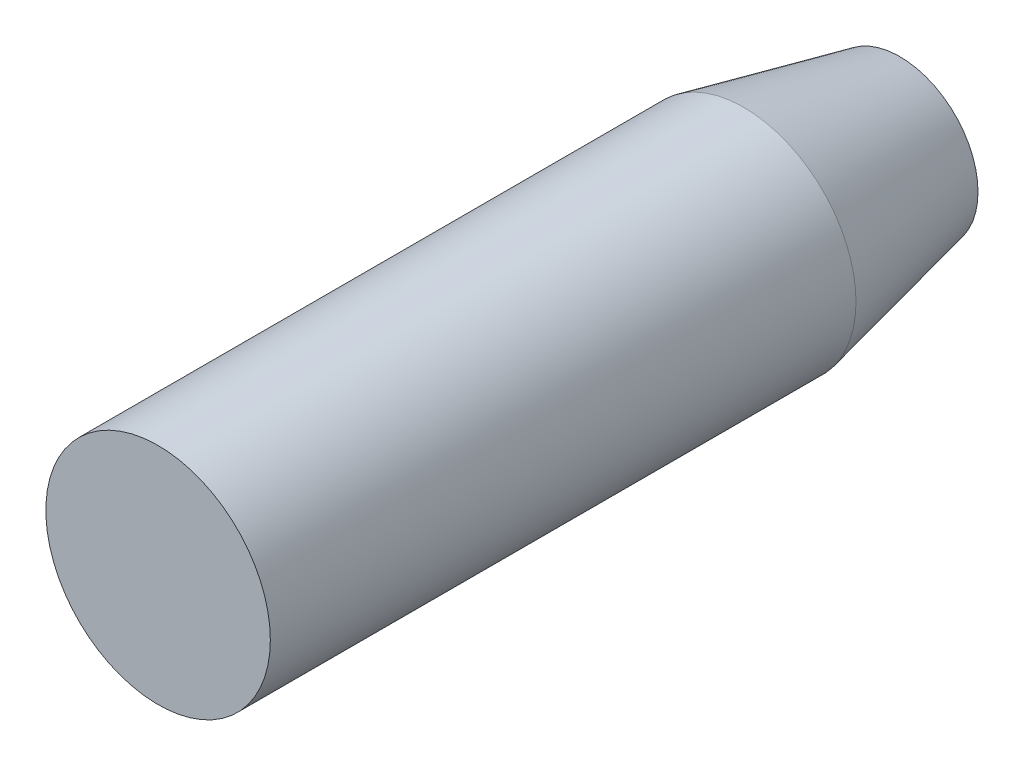
ISO-10303-21;
HEADER;
FILE_DESCRIPTION(('STEP AP214'),'2;1');
FILE_NAME('part.step','',(''),(''),'','','');
FILE_SCHEMA(('AUTOMOTIVE_DESIGN { 1 0 10303 214 1 1 1 1 }'));
ENDSEC;
DATA;
#1=APPLICATION_CONTEXT('core data for automotive mechanical design processes');
#2=APPLICATION_PROTOCOL_DEFINITION('international standard','automotive_design',2000,#1);
#3=PRODUCT_CONTEXT('',#1,'mechanical');
#4=PRODUCT('Part','Part','',(#3));
#5=PRODUCT_RELATED_PRODUCT_CATEGORY('part','',(#4));
#6=PRODUCT_DEFINITION_FORMATION('','',#4);
#7=PRODUCT_DEFINITION_CONTEXT('part definition',#1,'design');
#8=PRODUCT_DEFINITION('design','',#6,#7);
#9=PRODUCT_DEFINITION_SHAPE('','',#8);
#10=(LENGTH_UNIT() NAMED_UNIT(*) SI_UNIT(.MILLI.,.METRE.));
#11=(NAMED_UNIT(*) PLANE_ANGLE_UNIT() SI_UNIT($,.RADIAN.));
#12=(NAMED_UNIT(*) SI_UNIT($,.STERADIAN.) SOLID_ANGLE_UNIT());
#13=UNCERTAINTY_MEASURE_WITH_UNIT(LENGTH_MEASURE(1.E-05),#10,'distance_accuracy_value','');
#14=(GEOMETRIC_REPRESENTATION_CONTEXT(3) GLOBAL_UNCERTAINTY_ASSIGNED_CONTEXT((#13)) GLOBAL_UNIT_ASSIGNED_CONTEXT((#10,
#11,#12)) REPRESENTATION_CONTEXT('',''));
#15=CARTESIAN_POINT('',(0.,0.,0.));
#16=DIRECTION('',(0.,0.,1.));
#17=DIRECTION('',(1.,0.,0.));
#18=AXIS2_PLACEMENT_3D('',#15,#16,#17);
#19=CARTESIAN_POINT('',(0.,0.,0.));
#20=DIRECTION('',(0.,0.,1.));
#21=DIRECTION('',(1.,0.,0.));
#22=AXIS2_PLACEMENT_3D('',#19,#20,#21);
#23=PLANE('',#22);
#24=CARTESIAN_POINT('',(0.,0.,3.88231113923609E-12));
#25=DIRECTION('',(0.,0.,1.));
#26=DIRECTION('',(1.,0.,0.));
#27=AXIS2_PLACEMENT_3D('',#24,#25,#26);
#28=CIRCLE('',#27,12.6999999999822);
#29=CARTESIAN_POINT('',(12.6999999999822,0.,3.88231113923609E-12));
#30=VERTEX_POINT('',#29);
#31=EDGE_CURVE('E18',#30,#30,#28,.T.);
#32=ORIENTED_EDGE('',*,*,#31,.F.);
#33=EDGE_LOOP('',(#32));
#34=FACE_BOUND('',#33,.T.);
#35=ADVANCED_FACE('F15',(#34),#23,.F.);
#36=CARTESIAN_POINT('',(0.,0.,120.65));
#37=DIRECTION('',(0.,0.,1.));
#38=DIRECTION('',(1.,0.,0.));
#39=AXIS2_PLACEMENT_3D('',#36,#37,#38);
#40=PLANE('',#39);
#41=CARTESIAN_POINT('',(0.,0.,120.65));
#42=DIRECTION('',(0.,0.,1.));
#43=DIRECTION('',(1.,0.,0.));
#44=AXIS2_PLACEMENT_3D('',#41,#42,#43);
#45=CIRCLE('',#44,18.25625);
#46=CARTESIAN_POINT('',(18.25625,0.,120.65));
#47=VERTEX_POINT('',#46);
#48=EDGE_CURVE('E22',#47,#47,#45,.F.);
#49=ORIENTED_EDGE('',*,*,#48,.F.);
#50=EDGE_LOOP('',(#49));
#51=FACE_BOUND('',#50,.T.);
#52=ADVANCED_FACE('F38',(#51),#40,.T.);
#53=CARTESIAN_POINT('',(0.,0.,25.4));
#54=DIRECTION('',(0.,0.,1.));
#55=DIRECTION('',(1.,0.,0.));
#56=AXIS2_PLACEMENT_3D('',#53,#54,#55);
#57=CONICAL_SURFACE('',#56,18.25625,0.215357699698438);
#58=ORIENTED_EDGE('',*,*,#31,.T.);
#59=EDGE_LOOP('',(#58));
#60=FACE_BOUND('',#59,.T.);
#61=CARTESIAN_POINT('',(0.,0.,25.4));
#62=DIRECTION('',(0.,0.,1.));
#63=DIRECTION('',(1.,0.,0.));
#64=AXIS2_PLACEMENT_3D('',#61,#62,#63);
#65=CIRCLE('',#64,18.25625);
#66=CARTESIAN_POINT('',(18.25625,0.,25.4));
#67=VERTEX_POINT('',#66);
#68=EDGE_CURVE('E10',#67,#67,#65,.T.);
#69=ORIENTED_EDGE('',*,*,#68,.F.);
#70=EDGE_LOOP('',(#69));
#71=FACE_BOUND('',#70,.T.);
#72=ADVANCED_FACE('F34',(#60,#71),#57,.T.);
#73=CARTESIAN_POINT('',(0.,0.,0.));
#74=DIRECTION('',(0.,0.,1.));
#75=DIRECTION('',(1.,0.,0.));
#76=AXIS2_PLACEMENT_3D('',#73,#74,#75);
#77=CYLINDRICAL_SURFACE('',#76,18.25625);
#78=ORIENTED_EDGE('',*,*,#68,.T.);
#79=EDGE_LOOP('',(#78));
#80=FACE_BOUND('',#79,.T.);
#81=ORIENTED_EDGE('',*,*,#48,.T.);
#82=EDGE_LOOP('',(#81));
#83=FACE_BOUND('',#82,.T.);
#84=ADVANCED_FACE('F44',(#80,#83),#77,.T.);
#85=CLOSED_SHELL('',(#35,#52,#72,#84));
#86=MANIFOLD_SOLID_BREP('B1',#85);
#87=ADVANCED_BREP_SHAPE_REPRESENTATION('',(#18,#86),#14);
#88=SHAPE_DEFINITION_REPRESENTATION(#9,#87);
ENDSEC;
END-ISO-10303-21;
